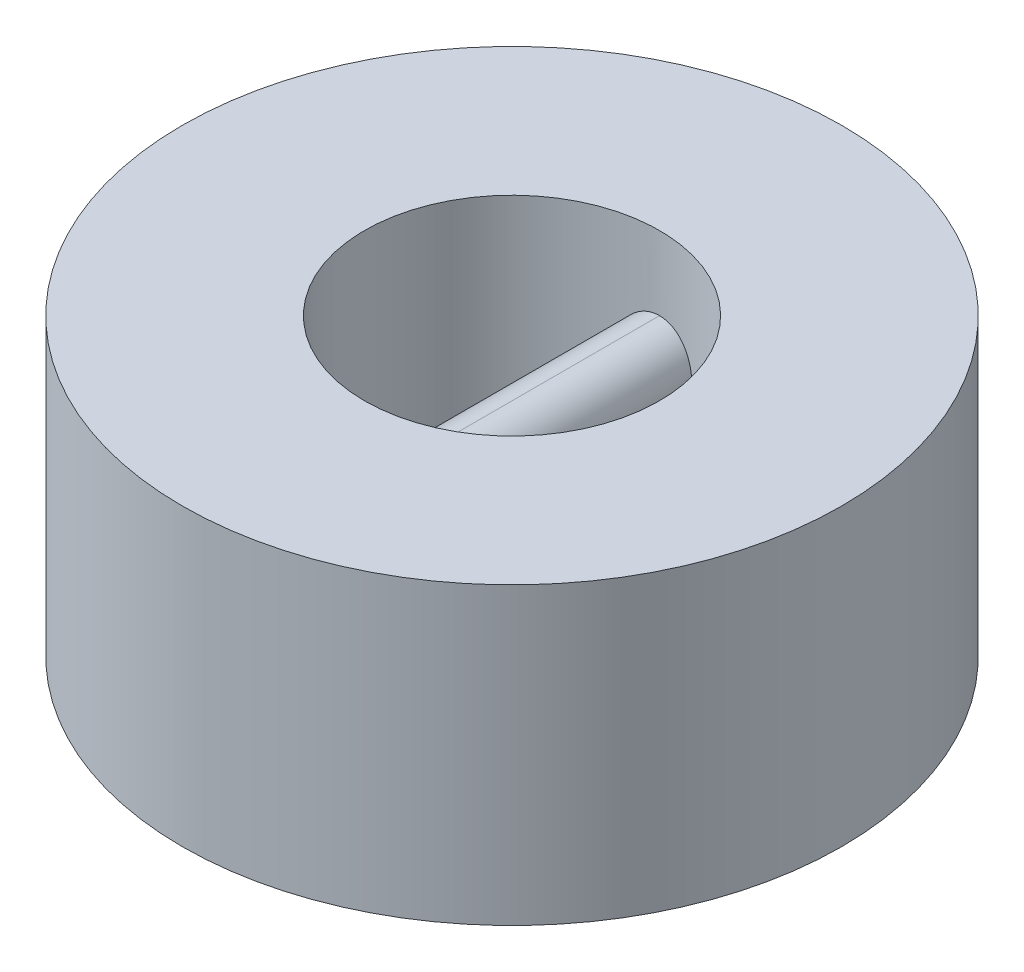
ISO-10303-21;
HEADER;
FILE_DESCRIPTION(('STEP AP214'),'2;1');
FILE_NAME('part.step','',(''),(''),'','','');
FILE_SCHEMA(('AUTOMOTIVE_DESIGN { 1 0 10303 214 1 1 1 1 }'));
ENDSEC;
DATA;
#1=APPLICATION_CONTEXT('core data for automotive mechanical design processes');
#2=APPLICATION_PROTOCOL_DEFINITION('international standard','automotive_design',2000,#1);
#3=PRODUCT_CONTEXT('',#1,'mechanical');
#4=PRODUCT('Part','Part','',(#3));
#5=PRODUCT_RELATED_PRODUCT_CATEGORY('part','',(#4));
#6=PRODUCT_DEFINITION_FORMATION('','',#4);
#7=PRODUCT_DEFINITION_CONTEXT('part definition',#1,'design');
#8=PRODUCT_DEFINITION('design','',#6,#7);
#9=PRODUCT_DEFINITION_SHAPE('','',#8);
#10=(LENGTH_UNIT() NAMED_UNIT(*) SI_UNIT(.MILLI.,.METRE.));
#11=(NAMED_UNIT(*) PLANE_ANGLE_UNIT() SI_UNIT($,.RADIAN.));
#12=(NAMED_UNIT(*) SI_UNIT($,.STERADIAN.) SOLID_ANGLE_UNIT());
#13=UNCERTAINTY_MEASURE_WITH_UNIT(LENGTH_MEASURE(1.E-05),#10,'distance_accuracy_value','');
#14=(GEOMETRIC_REPRESENTATION_CONTEXT(3) GLOBAL_UNCERTAINTY_ASSIGNED_CONTEXT((#13)) GLOBAL_UNIT_ASSIGNED_CONTEXT((#10,
#11,#12)) REPRESENTATION_CONTEXT('',''));
#15=CARTESIAN_POINT('',(0.,0.,0.));
#16=DIRECTION('',(0.,0.,1.));
#17=DIRECTION('',(1.,0.,0.));
#18=AXIS2_PLACEMENT_3D('',#15,#16,#17);
#19=CARTESIAN_POINT('',(0.,25.4,0.));
#20=DIRECTION('',(0.,-1.,0.));
#21=DIRECTION('',(0.,0.,-1.));
#22=AXIS2_PLACEMENT_3D('',#19,#20,#21);
#23=CYLINDRICAL_SURFACE('',#22,56.7645955077655);
#24=CARTESIAN_POINT('',(0.,25.4,0.));
#25=DIRECTION('',(0.,1.,0.));
#26=DIRECTION('',(0.,0.,1.));
#27=AXIS2_PLACEMENT_3D('',#24,#25,#26);
#28=CIRCLE('',#27,56.7645955077655);
#29=CARTESIAN_POINT('',(0.,25.4,56.7645955077655));
#30=VERTEX_POINT('',#29);
#31=EDGE_CURVE('E100',#30,#30,#28,.T.);
#32=ORIENTED_EDGE('',*,*,#31,.F.);
#33=EDGE_LOOP('',(#32));
#34=FACE_BOUND('',#33,.T.);
#35=CARTESIAN_POINT('',(0.,-25.4,0.));
#36=DIRECTION('',(0.,1.,0.));
#37=DIRECTION('',(0.,0.,1.));
#38=AXIS2_PLACEMENT_3D('',#35,#36,#37);
#39=CIRCLE('',#38,56.7645955077655);
#40=CARTESIAN_POINT('',(0.,-25.4,56.7645955077655));
#41=VERTEX_POINT('',#40);
#42=EDGE_CURVE('E104',#41,#41,#39,.T.);
#43=ORIENTED_EDGE('',*,*,#42,.T.);
#44=EDGE_LOOP('',(#43));
#45=FACE_BOUND('',#44,.T.);
#46=ADVANCED_FACE('F37',(#34,#45),#23,.T.);
#47=CARTESIAN_POINT('',(0.,25.4,0.));
#48=DIRECTION('',(0.,1.,0.));
#49=DIRECTION('',(0.,0.,1.));
#50=AXIS2_PLACEMENT_3D('',#47,#48,#49);
#51=PLANE('',#50);
#52=CARTESIAN_POINT('',(0.,25.4,0.));
#53=DIRECTION('',(0.,1.,0.));
#54=DIRECTION('',(0.,0.,1.));
#55=AXIS2_PLACEMENT_3D('',#52,#53,#54);
#56=CIRCLE('',#55,25.4);
#57=CARTESIAN_POINT('',(0.,25.4,25.4));
#58=VERTEX_POINT('',#57);
#59=EDGE_CURVE('E169',#58,#58,#56,.T.);
#60=ORIENTED_EDGE('',*,*,#59,.F.);
#61=EDGE_LOOP('',(#60));
#62=FACE_BOUND('',#61,.T.);
#63=ORIENTED_EDGE('',*,*,#31,.T.);
#64=EDGE_LOOP('',(#63));
#65=FACE_BOUND('',#64,.T.);
#66=ADVANCED_FACE('F125',(#62,#65),#51,.T.);
#67=CARTESIAN_POINT('',(0.,-25.4,0.));
#68=DIRECTION('',(0.,1.,0.));
#69=DIRECTION('',(0.,0.,1.));
#70=AXIS2_PLACEMENT_3D('',#67,#68,#69);
#71=PLANE('',#70);
#72=CARTESIAN_POINT('',(0.,-25.4,0.));
#73=DIRECTION('',(0.,1.,0.));
#74=DIRECTION('',(0.,0.,1.));
#75=AXIS2_PLACEMENT_3D('',#72,#73,#74);
#76=CIRCLE('',#75,25.4);
#77=CARTESIAN_POINT('',(0.,-25.4,25.4));
#78=VERTEX_POINT('',#77);
#79=EDGE_CURVE('E167',#78,#78,#76,.T.);
#80=ORIENTED_EDGE('',*,*,#79,.T.);
#81=EDGE_LOOP('',(#80));
#82=FACE_BOUND('',#81,.T.);
#83=ORIENTED_EDGE('',*,*,#42,.F.);
#84=EDGE_LOOP('',(#83));
#85=FACE_BOUND('',#84,.T.);
#86=ADVANCED_FACE('F124',(#82,#85),#71,.F.);
#87=CARTESIAN_POINT('',(0.,25.4,0.));
#88=DIRECTION('',(0.,-1.,0.));
#89=DIRECTION('',(0.,0.,-1.));
#90=AXIS2_PLACEMENT_3D('',#87,#88,#89);
#91=CYLINDRICAL_SURFACE('',#90,25.4);
#92=CARTESIAN_POINT('',(-6.35,6.35,-24.5934442484171));
#93=CARTESIAN_POINT('',(-6.35002227194527,6.52561230663582,-24.5934239927346));
#94=CARTESIAN_POINT('',(-6.34271602928819,6.70121754155172,-24.5953245336112));
#95=CARTESIAN_POINT('',(-6.31361032223786,7.05111477777355,-24.6028197742441));
#96=CARTESIAN_POINT('',(-6.29181329827677,7.2254069952106,-24.6084138519605));
#97=CARTESIAN_POINT('',(-6.23394880924157,7.57108618789087,-24.623133796363));
#98=CARTESIAN_POINT('',(-6.19791054295239,7.7424783639397,-24.6322524358168));
#99=CARTESIAN_POINT('',(-6.11186947681422,8.08151201134434,-24.6537426934591));
#100=CARTESIAN_POINT('',(-6.06186648577146,8.24915343131388,-24.6661143561854));
#101=CARTESIAN_POINT('',(-5.94831229287981,8.57947899433355,-24.6937438862104));
#102=CARTESIAN_POINT('',(-5.88476510397179,8.74216458943754,-24.7090008984732));
#103=CARTESIAN_POINT('',(-5.74457525001978,9.06160293422282,-24.7419691924501));
#104=CARTESIAN_POINT('',(-5.66792774357013,9.21835346426258,-24.7596813810499));
#105=CARTESIAN_POINT('',(-5.50212032510756,9.52482667069534,-24.7970540455721));
#106=CARTESIAN_POINT('',(-5.41296152003303,9.67454996726135,-24.8167143490896));
#107=CARTESIAN_POINT('',(-5.22271366631799,9.96608497019353,-24.8574480830195));
#108=CARTESIAN_POINT('',(-5.12162038676159,10.1078938444037,-24.8785220134296));
#109=CARTESIAN_POINT('',(-4.9061197613706,10.3853364870191,-24.921924087667));
#110=CARTESIAN_POINT('',(-4.79149125344267,10.520795944865,-24.9442686743028));
#111=CARTESIAN_POINT('',(-4.55132734389885,10.7816304952267,-24.9892044740816));
#112=CARTESIAN_POINT('',(-4.42579182524735,10.9070054795053,-25.0117956898687));
#113=CARTESIAN_POINT('',(-4.16458861400217,11.1468901748564,-25.0566111555918));
#114=CARTESIAN_POINT('',(-4.02891724783083,11.2613959120672,-25.0788352688789));
#115=CARTESIAN_POINT('',(-3.74841452327989,11.4786793130291,-25.1222913173633));
#116=CARTESIAN_POINT('',(-3.60358637431179,11.5814610509585,-25.143523595707));
#117=CARTESIAN_POINT('',(-3.30348900105029,11.7760394267589,-25.1847220960044));
#118=CARTESIAN_POINT('',(-3.14809798643044,11.8676532723995,-25.2046652401187));
#119=CARTESIAN_POINT('',(-2.8299383132475,12.0373938940376,-25.242367199895));
#120=CARTESIAN_POINT('',(-2.6671724296331,12.1155256905948,-25.2601268279618));
#121=CARTESIAN_POINT('',(-2.33540999905884,12.2576987594075,-25.2929558581139));
#122=CARTESIAN_POINT('',(-2.16641621313577,12.3217461900409,-25.3080264354386));
#123=CARTESIAN_POINT('',(-1.82343036647629,12.4352486370264,-25.3350493425419));
#124=CARTESIAN_POINT('',(-1.64943954845311,12.4847072475772,-25.3470024402792));
#125=CARTESIAN_POINT('',(-1.23261046983848,12.5841324737492,-25.3712184338473));
#126=CARTESIAN_POINT('',(-0.988067156213775,12.6275468384329,-25.3819668292946));
#127=CARTESIAN_POINT('',(-0.618813882655509,12.6709937824,-25.3927607621345));
#128=CARTESIAN_POINT('',(-0.495346717367013,12.6818636554792,-25.3954706206766));
#129=CARTESIAN_POINT('',(-0.247932014798074,12.6963671643469,-25.3990914576642));
#130=CARTESIAN_POINT('',(-0.123984369038978,12.6999990576339,-25.4000020029351));
#131=CARTESIAN_POINT('',(0.,12.7,-25.4));
#132=B_SPLINE_CURVE_WITH_KNOTS('',3,(#92,#93,#94,#95,#96,#97,#98,#99,#100,#101,#102,#103,#104,
#105,#106,#107,#108,#109,#110,#111,#112,#113,#114,#115,#116,#117,#118,#119,#120,#121,#122,#123,
#124,#125,#126,#127,#128,#129,#130,#131),.UNSPECIFIED.,.F.,.F.,(4,2,2,2,2,2,2,2,2,2,2,2,2,2,2,2,
2,2,2,4),(0.,0.526663939512959,1.05323920457144,1.57874038903873,2.10424876859807,
2.62960166388249,3.15514913215339,3.68065013184214,4.20633799063145,4.74227555780805,
5.27821887647133,5.81435739055571,6.3503090211691,6.89410473158633,7.43769749966614,
7.98105210753416,8.52427273892373,9.26802282823714,9.63975692173094,10.0115804972446),.UNSPECIFIED.);
#133=CARTESIAN_POINT('',(-6.35,6.35,-24.5934442484171));
#134=VERTEX_POINT('',#133);
#135=CARTESIAN_POINT('',(0.,12.7,-25.4));
#136=VERTEX_POINT('',#135);
#137=EDGE_CURVE('E138',#134,#136,#132,.T.);
#138=ORIENTED_EDGE('',*,*,#137,.T.);
#139=CARTESIAN_POINT('',(0.,12.7,-25.4));
#140=CARTESIAN_POINT('',(0.175699112745943,12.7000220804563,-25.400017975796));
#141=CARTESIAN_POINT('',(0.351391661153618,12.6927088115871,-25.3981775930792));
#142=CARTESIAN_POINT('',(0.70146847944646,12.6635736421459,-25.390910660224));
#143=CARTESIAN_POINT('',(0.875852948678401,12.641753999669,-25.3854846682306));
#144=CARTESIAN_POINT('',(1.22173410057335,12.5838249732516,-25.371191034762));
#145=CARTESIAN_POINT('',(1.39323578022403,12.5477437256559,-25.3623301705151));
#146=CARTESIAN_POINT('',(1.73249008753074,12.4615957285789,-25.3414156260248));
#147=CARTESIAN_POINT('',(1.90024267560781,12.4115288315272,-25.3293619120918));
#148=CARTESIAN_POINT('',(2.23079828457177,12.2978217165225,-25.3023919641378));
#149=CARTESIAN_POINT('',(2.39360246105478,12.234184695844,-25.2874764044829));
#150=CARTESIAN_POINT('',(2.71326830549007,12.0937932443795,-25.2551775719313));
#151=CARTESIAN_POINT('',(2.87012775233453,12.0170339686659,-25.2377933879854));
#152=CARTESIAN_POINT('',(3.17679611830026,11.8509878661557,-25.2010280861743));
#153=CARTESIAN_POINT('',(3.32660591396608,11.7617026023499,-25.1816472175351));
#154=CARTESIAN_POINT('',(3.61829097828095,11.5711900972236,-25.1413933023157));
#155=CARTESIAN_POINT('',(3.76016340825691,11.4699586232679,-25.1205197278967));
#156=CARTESIAN_POINT('',(4.03752149340217,11.2543179160353,-25.0774495203203));
#157=CARTESIAN_POINT('',(4.1728444995166,11.1397028600178,-25.055235750209));
#158=CARTESIAN_POINT('',(4.43340459333218,10.8995945735081,-25.0104458745798));
#159=CARTESIAN_POINT('',(4.5586415634769,10.7741012162606,-24.9878697648425));
#160=CARTESIAN_POINT('',(4.79825666182264,10.5130086354736,-24.9429669572739));
#161=CARTESIAN_POINT('',(4.91263050361572,10.3774054601307,-24.9206403609374));
#162=CARTESIAN_POINT('',(5.12965927844439,10.0970666078969,-24.8768737932251));
#163=CARTESIAN_POINT('',(5.23231826147259,9.95233411417394,-24.8554335170807));
#164=CARTESIAN_POINT('',(5.42675306700318,9.65231692226906,-24.8137138574612));
#165=CARTESIAN_POINT('',(5.51833490059263,9.4969031629791,-24.793457701424));
#166=CARTESIAN_POINT('',(5.68800918571879,9.17870159482844,-24.7550826627609));
#167=CARTESIAN_POINT('',(5.76610666043027,9.01591656055351,-24.7369629850583));
#168=CARTESIAN_POINT('',(5.90820875096747,8.6841194086145,-24.7034087739443));
#169=CARTESIAN_POINT('',(5.9722199872795,8.51511026005323,-24.6879729798355));
#170=CARTESIAN_POINT('',(6.08565076734827,8.17208836221375,-24.6602565008038));
#171=CARTESIAN_POINT('',(6.13507393782816,7.9980768683885,-24.6479750317865));
#172=CARTESIAN_POINT('',(6.23434903022083,7.58146255495799,-24.623088225217));
#173=CARTESIAN_POINT('',(6.27768000264913,7.33715972406042,-24.6120234297577));
#174=CARTESIAN_POINT('',(6.32104597393651,6.96825749872608,-24.6009057580366));
#175=CARTESIAN_POINT('',(6.33189620972373,6.84490213869051,-24.5981131298308));
#176=CARTESIAN_POINT('',(6.34637366253408,6.59771016979374,-24.5943809423169));
#177=CARTESIAN_POINT('',(6.34999911576239,6.47387345080924,-24.5934418355117));
#178=CARTESIAN_POINT('',(6.35,6.35,-24.5934442484171));
#179=B_SPLINE_CURVE_WITH_KNOTS('',3,(#139,#140,#141,#142,#143,#144,#145,#146,#147,#148,#149,
#150,#151,#152,#153,#154,#155,#156,#157,#158,#159,#160,#161,#162,#163,#164,#165,#166,#167,#168,
#169,#170,#171,#172,#173,#174,#175,#176,#177,#178),.UNSPECIFIED.,.F.,.F.,(4,2,2,2,2,2,2,2,2,2,2,
2,2,2,2,2,2,2,2,4),(0.,0.526925597782802,1.0537691923278,1.57957853781272,2.10539343161848,
2.63108457410907,3.15697023028003,3.68279032479073,4.20879728398118,4.74435095586272,
5.27991086891469,5.81568123454489,6.35126581200508,6.89517616377623,7.43888345960203,
7.98233466638267,8.52565065233463,9.2686898571845,9.64008996098021,10.0115807240259),.UNSPECIFIED.);
#180=CARTESIAN_POINT('',(6.35,6.35,-24.5934442484171));
#181=VERTEX_POINT('',#180);
#182=EDGE_CURVE('E47',#136,#181,#179,.T.);
#183=ORIENTED_EDGE('',*,*,#182,.T.);
#184=CARTESIAN_POINT('',(6.35,6.35,-24.5934442484171));
#185=CARTESIAN_POINT('',(6.35002227194526,6.17438769336418,-24.5934239927346));
#186=CARTESIAN_POINT('',(6.34271602928819,5.99878245844828,-24.5953245336112));
#187=CARTESIAN_POINT('',(6.31361032223786,5.64888522222645,-24.6028197742441));
#188=CARTESIAN_POINT('',(6.29181329827677,5.4745930047894,-24.6084138519605));
#189=CARTESIAN_POINT('',(6.23394880924157,5.12891381210913,-24.623133796363));
#190=CARTESIAN_POINT('',(6.19791054295238,4.9575216360603,-24.6322524358168));
#191=CARTESIAN_POINT('',(6.11186947681422,4.61848798865566,-24.6537426934591));
#192=CARTESIAN_POINT('',(6.06186648577146,4.45084656868612,-24.6661143561854));
#193=CARTESIAN_POINT('',(5.9483122928798,4.12052100566645,-24.6937438862104));
#194=CARTESIAN_POINT('',(5.88476510397178,3.95783541056246,-24.7090008984732));
#195=CARTESIAN_POINT('',(5.74457525001977,3.63839706577718,-24.7419691924501));
#196=CARTESIAN_POINT('',(5.66792774357012,3.48164653573742,-24.7596813810499));
#197=CARTESIAN_POINT('',(5.50212032510755,3.17517332930466,-24.7970540455721));
#198=CARTESIAN_POINT('',(5.41296152003302,3.02545003273865,-24.8167143490896));
#199=CARTESIAN_POINT('',(5.22271366631798,2.73391502980647,-24.8574480830195));
#200=CARTESIAN_POINT('',(5.12162038676159,2.59210615559632,-24.8785220134296));
#201=CARTESIAN_POINT('',(4.9061197613706,2.3146635129809,-24.921924087667));
#202=CARTESIAN_POINT('',(4.79149125344267,2.17920405513501,-24.9442686743028));
#203=CARTESIAN_POINT('',(4.55132734389885,1.91836950477326,-24.9892044740816));
#204=CARTESIAN_POINT('',(4.42579182524735,1.79299452049473,-25.0117956898687));
#205=CARTESIAN_POINT('',(4.16458861400217,1.55310982514357,-25.0566111555918));
#206=CARTESIAN_POINT('',(4.02891724783083,1.43860408793282,-25.0788352688789));
#207=CARTESIAN_POINT('',(3.74841452327989,1.22132068697092,-25.1222913173633));
#208=CARTESIAN_POINT('',(3.60358637431179,1.11853894904149,-25.143523595707));
#209=CARTESIAN_POINT('',(3.30348900105029,0.923960573241089,-25.1847220960044));
#210=CARTESIAN_POINT('',(3.14809798643044,0.83234672760047,-25.2046652401187));
#211=CARTESIAN_POINT('',(2.8299383132475,0.662606105962379,-25.242367199895));
#212=CARTESIAN_POINT('',(2.6671724296331,0.584474309405154,-25.2601268279618));
#213=CARTESIAN_POINT('',(2.33540999905883,0.442301240592473,-25.2929558581139));
#214=CARTESIAN_POINT('',(2.16641621313577,0.378253809959063,-25.3080264354386));
#215=CARTESIAN_POINT('',(1.82343036647629,0.264751362973618,-25.3350493425419));
#216=CARTESIAN_POINT('',(1.64943954845311,0.215292752422795,-25.3470024402792));
#217=CARTESIAN_POINT('',(1.23261046983848,0.11586752625075,-25.3712184338473));
#218=CARTESIAN_POINT('',(0.988067156213775,0.0724531615671009,-25.3819668292946));
#219=CARTESIAN_POINT('',(0.618813882655508,0.0290062175999961,-25.3927607621345));
#220=CARTESIAN_POINT('',(0.495346717367012,0.0181363445208444,-25.3954706206766));
#221=CARTESIAN_POINT('',(0.247932014798072,0.00363283565306978,-25.3990914576642));
#222=CARTESIAN_POINT('',(0.123984369038976,9.42366073517722E-07,-25.4000020029351));
#223=CARTESIAN_POINT('',(0.,0.,-25.4));
#224=B_SPLINE_CURVE_WITH_KNOTS('',3,(#184,#185,#186,#187,#188,#189,#190,#191,#192,#193,#194,
#195,#196,#197,#198,#199,#200,#201,#202,#203,#204,#205,#206,#207,#208,#209,#210,#211,#212,#213,
#214,#215,#216,#217,#218,#219,#220,#221,#222,#223),.UNSPECIFIED.,.F.,.F.,(4,2,2,2,2,2,2,2,2,2,2,
2,2,2,2,2,2,2,2,4),(0.,0.526663939512958,1.05323920457144,1.57874038903872,2.10424876859807,
2.62960166388249,3.15514913215339,3.68065013184214,4.20633799063145,4.74227555780805,
5.27821887647132,5.81435739055571,6.3503090211691,6.89410473158633,7.43769749966614,
7.98105210753415,8.52427273892373,9.26802282823714,9.63975692173094,10.0115804972446),.UNSPECIFIED.);
#225=CARTESIAN_POINT('',(0.,0.,-25.4));
#226=VERTEX_POINT('',#225);
#227=EDGE_CURVE('E93',#181,#226,#224,.T.);
#228=ORIENTED_EDGE('',*,*,#227,.T.);
#229=CARTESIAN_POINT('',(0.,0.,-25.4));
#230=CARTESIAN_POINT('',(-0.175699112745945,-2.20804563280517E-05,-25.400017975796));
#231=CARTESIAN_POINT('',(-0.35139166115362,0.00729118841288751,-25.3981775930792));
#232=CARTESIAN_POINT('',(-0.701468479446463,0.0364263578541068,-25.390910660224));
#233=CARTESIAN_POINT('',(-0.875852948678403,0.0582460003310183,-25.3854846682306));
#234=CARTESIAN_POINT('',(-1.22173410057335,0.116175026748358,-25.371191034762));
#235=CARTESIAN_POINT('',(-1.39323578022404,0.152256274344142,-25.3623301705151));
#236=CARTESIAN_POINT('',(-1.73249008753074,0.238404271421113,-25.3414156260248));
#237=CARTESIAN_POINT('',(-1.90024267560781,0.288471168472784,-25.3293619120918));
#238=CARTESIAN_POINT('',(-2.23079828457178,0.402178283477457,-25.3023919641378));
#239=CARTESIAN_POINT('',(-2.39360246105478,0.465815304156032,-25.2874764044829));
#240=CARTESIAN_POINT('',(-2.71326830549007,0.60620675562051,-25.2551775719313));
#241=CARTESIAN_POINT('',(-2.87012775233453,0.682966031334097,-25.2377933879854));
#242=CARTESIAN_POINT('',(-3.17679611830026,0.849012133844301,-25.2010280861743));
#243=CARTESIAN_POINT('',(-3.32660591396609,0.93829739765012,-25.1816472175351));
#244=CARTESIAN_POINT('',(-3.61829097828096,1.12880990277645,-25.1413933023157));
#245=CARTESIAN_POINT('',(-3.76016340825692,1.23004137673206,-25.1205197278967));
#246=CARTESIAN_POINT('',(-4.03752149340217,1.44568208396469,-25.0774495203203));
#247=CARTESIAN_POINT('',(-4.1728444995166,1.56029713998218,-25.055235750209));
#248=CARTESIAN_POINT('',(-4.43340459333218,1.80040542649192,-25.0104458745798));
#249=CARTESIAN_POINT('',(-4.5586415634769,1.92589878373936,-24.9878697648425));
#250=CARTESIAN_POINT('',(-4.79825666182264,2.18699136452638,-24.9429669572739));
#251=CARTESIAN_POINT('',(-4.91263050361572,2.32259453986927,-24.9206403609374));
#252=CARTESIAN_POINT('',(-5.12965927844439,2.60293339210308,-24.8768737932251));
#253=CARTESIAN_POINT('',(-5.23231826147259,2.74766588582606,-24.8554335170807));
#254=CARTESIAN_POINT('',(-5.42675306700318,3.04768307773094,-24.8137138574612));
#255=CARTESIAN_POINT('',(-5.51833490059264,3.2030968370209,-24.793457701424));
#256=CARTESIAN_POINT('',(-5.68800918571879,3.52129840517156,-24.7550826627609));
#257=CARTESIAN_POINT('',(-5.76610666043027,3.68408343944649,-24.7369629850583));
#258=CARTESIAN_POINT('',(-5.90820875096747,4.0158805913855,-24.7034087739443));
#259=CARTESIAN_POINT('',(-5.9722199872795,4.18488973994677,-24.6879729798355));
#260=CARTESIAN_POINT('',(-6.08565076734827,4.52791163778625,-24.6602565008038));
#261=CARTESIAN_POINT('',(-6.13507393782816,4.70192313161149,-24.6479750317865));
#262=CARTESIAN_POINT('',(-6.23434903022084,5.11853744504201,-24.623088225217));
#263=CARTESIAN_POINT('',(-6.27768000264913,5.36284027593958,-24.6120234297577));
#264=CARTESIAN_POINT('',(-6.32104597393651,5.73174250127392,-24.6009057580366));
#265=CARTESIAN_POINT('',(-6.33189620972373,5.85509786130948,-24.5981131298308));
#266=CARTESIAN_POINT('',(-6.34637366253409,6.10228983020626,-24.5943809423169));
#267=CARTESIAN_POINT('',(-6.34999911576239,6.22612654919075,-24.5934418355116));
#268=CARTESIAN_POINT('',(-6.35,6.35,-24.5934442484171));
#269=B_SPLINE_CURVE_WITH_KNOTS('',3,(#229,#230,#231,#232,#233,#234,#235,#236,#237,#238,#239,
#240,#241,#242,#243,#244,#245,#246,#247,#248,#249,#250,#251,#252,#253,#254,#255,#256,#257,#258,
#259,#260,#261,#262,#263,#264,#265,#266,#267,#268),.UNSPECIFIED.,.F.,.F.,(4,2,2,2,2,2,2,2,2,2,2,
2,2,2,2,2,2,2,2,4),(0.,0.526925597782802,1.0537691923278,1.57957853781271,2.10539343161848,
2.63108457410907,3.15697023028003,3.68279032479073,4.20879728398118,4.74435095586272,
5.27991086891469,5.81568123454488,6.35126581200508,6.89517616377623,7.43888345960202,
7.98233466638266,8.52565065233463,9.2686898571845,9.64008996098021,10.0115807240259),.UNSPECIFIED.);
#270=EDGE_CURVE('E85',#226,#134,#269,.T.);
#271=ORIENTED_EDGE('',*,*,#270,.T.);
#272=EDGE_LOOP('',(#138,#183,#228,#271));
#273=FACE_BOUND('',#272,.T.);
#274=CARTESIAN_POINT('',(0.,0.,25.4));
#275=CARTESIAN_POINT('',(0.17569911274594,-2.20804563294313E-05,25.400017975796));
#276=CARTESIAN_POINT('',(0.351391661153615,0.00729118841288655,25.3981775930792));
#277=CARTESIAN_POINT('',(0.701468479446457,0.0364263578541074,25.390910660224));
#278=CARTESIAN_POINT('',(0.875852948678397,0.0582460003310199,25.3854846682306));
#279=CARTESIAN_POINT('',(1.22173410057335,0.116175026748359,25.371191034762));
#280=CARTESIAN_POINT('',(1.39323578022403,0.152256274344142,25.3623301705151));
#281=CARTESIAN_POINT('',(1.73249008753074,0.238404271421113,25.3414156260248));
#282=CARTESIAN_POINT('',(1.90024267560781,0.288471168472784,25.3293619120918));
#283=CARTESIAN_POINT('',(2.23079828457177,0.402178283477458,25.3023919641378));
#284=CARTESIAN_POINT('',(2.39360246105477,0.465815304156032,25.2874764044829));
#285=CARTESIAN_POINT('',(2.71326830549006,0.60620675562051,25.2551775719313));
#286=CARTESIAN_POINT('',(2.87012775233452,0.682966031334097,25.2377933879854));
#287=CARTESIAN_POINT('',(3.17679611830025,0.8490121338443,25.2010280861743));
#288=CARTESIAN_POINT('',(3.32660591396608,0.938297397650119,25.1816472175351));
#289=CARTESIAN_POINT('',(3.61829097828095,1.12880990277645,25.1413933023157));
#290=CARTESIAN_POINT('',(3.76016340825691,1.23004137673206,25.1205197278967));
#291=CARTESIAN_POINT('',(4.03752149340217,1.44568208396469,25.0774495203203));
#292=CARTESIAN_POINT('',(4.1728444995166,1.56029713998218,25.055235750209));
#293=CARTESIAN_POINT('',(4.43340459333218,1.80040542649192,25.0104458745798));
#294=CARTESIAN_POINT('',(4.5586415634769,1.92589878373936,24.9878697648425));
#295=CARTESIAN_POINT('',(4.79825666182263,2.18699136452638,24.9429669572739));
#296=CARTESIAN_POINT('',(4.91263050361572,2.32259453986927,24.9206403609374));
#297=CARTESIAN_POINT('',(5.12965927844438,2.60293339210308,24.8768737932251));
#298=CARTESIAN_POINT('',(5.23231826147258,2.74766588582606,24.8554335170807));
#299=CARTESIAN_POINT('',(5.42675306700318,3.04768307773094,24.8137138574612));
#300=CARTESIAN_POINT('',(5.51833490059263,3.2030968370209,24.793457701424));
#301=CARTESIAN_POINT('',(5.68800918571878,3.52129840517156,24.7550826627609));
#302=CARTESIAN_POINT('',(5.76610666043026,3.68408343944649,24.7369629850583));
#303=CARTESIAN_POINT('',(5.90820875096746,4.0158805913855,24.7034087739443));
#304=CARTESIAN_POINT('',(5.97221998727949,4.18488973994678,24.6879729798355));
#305=CARTESIAN_POINT('',(6.08565076734827,4.52791163778625,24.6602565008038));
#306=CARTESIAN_POINT('',(6.13507393782816,4.7019231316115,24.6479750317865));
#307=CARTESIAN_POINT('',(6.23434903022083,5.11853744504201,24.623088225217));
#308=CARTESIAN_POINT('',(6.27768000264913,5.36284027593958,24.6120234297577));
#309=CARTESIAN_POINT('',(6.32104597393651,5.73174250127392,24.6009057580366));
#310=CARTESIAN_POINT('',(6.33189620972373,5.85509786130949,24.5981131298308));
#311=CARTESIAN_POINT('',(6.34637366253408,6.10228983020627,24.5943809423169));
#312=CARTESIAN_POINT('',(6.34999911576239,6.22612654919076,24.5934418355116));
#313=CARTESIAN_POINT('',(6.35,6.35,24.5934442484171));
#314=B_SPLINE_CURVE_WITH_KNOTS('',3,(#274,#275,#276,#277,#278,#279,#280,#281,#282,#283,#284,
#285,#286,#287,#288,#289,#290,#291,#292,#293,#294,#295,#296,#297,#298,#299,#300,#301,#302,#303,
#304,#305,#306,#307,#308,#309,#310,#311,#312,#313),.UNSPECIFIED.,.F.,.F.,(4,2,2,2,2,2,2,2,2,2,2,
2,2,2,2,2,2,2,2,4),(0.,0.526925597782802,1.0537691923278,1.57957853781271,2.10539343161848,
2.63108457410907,3.15697023028003,3.68279032479073,4.20879728398118,4.74435095586272,
5.27991086891469,5.81568123454488,6.35126581200508,6.89517616377623,7.43888345960203,
7.98233466638267,8.52565065233464,9.2686898571845,9.64008996098021,10.0115807240259),.UNSPECIFIED.);
#315=CARTESIAN_POINT('',(0.,0.,25.4));
#316=VERTEX_POINT('',#315);
#317=CARTESIAN_POINT('',(6.35,6.35,24.5934442484171));
#318=VERTEX_POINT('',#317);
#319=EDGE_CURVE('E54',#316,#318,#314,.T.);
#320=ORIENTED_EDGE('',*,*,#319,.T.);
#321=CARTESIAN_POINT('',(6.35,6.35,24.5934442484171));
#322=CARTESIAN_POINT('',(6.35002227194527,6.52561230663582,24.5934239927346));
#323=CARTESIAN_POINT('',(6.34271602928819,6.70121754155172,24.5953245336112));
#324=CARTESIAN_POINT('',(6.31361032223786,7.05111477777355,24.6028197742441));
#325=CARTESIAN_POINT('',(6.29181329827677,7.2254069952106,24.6084138519605));
#326=CARTESIAN_POINT('',(6.23394880924157,7.57108618789087,24.623133796363));
#327=CARTESIAN_POINT('',(6.19791054295239,7.7424783639397,24.6322524358168));
#328=CARTESIAN_POINT('',(6.11186947681422,8.08151201134434,24.6537426934591));
#329=CARTESIAN_POINT('',(6.06186648577146,8.24915343131388,24.6661143561854));
#330=CARTESIAN_POINT('',(5.94831229287981,8.57947899433355,24.6937438862104));
#331=CARTESIAN_POINT('',(5.88476510397178,8.74216458943754,24.7090008984732));
#332=CARTESIAN_POINT('',(5.74457525001978,9.06160293422282,24.7419691924501));
#333=CARTESIAN_POINT('',(5.66792774357013,9.21835346426258,24.7596813810499));
#334=CARTESIAN_POINT('',(5.50212032510755,9.52482667069534,24.7970540455721));
#335=CARTESIAN_POINT('',(5.41296152003303,9.67454996726135,24.8167143490896));
#336=CARTESIAN_POINT('',(5.22271366631798,9.96608497019353,24.8574480830195));
#337=CARTESIAN_POINT('',(5.12162038676159,10.1078938444037,24.8785220134296));
#338=CARTESIAN_POINT('',(4.9061197613706,10.3853364870191,24.921924087667));
#339=CARTESIAN_POINT('',(4.79149125344267,10.520795944865,24.9442686743028));
#340=CARTESIAN_POINT('',(4.55132734389885,10.7816304952267,24.9892044740816));
#341=CARTESIAN_POINT('',(4.42579182524735,10.9070054795053,25.0117956898687));
#342=CARTESIAN_POINT('',(4.16458861400217,11.1468901748564,25.0566111555918));
#343=CARTESIAN_POINT('',(4.02891724783083,11.2613959120672,25.0788352688789));
#344=CARTESIAN_POINT('',(3.74841452327989,11.4786793130291,25.1222913173633));
#345=CARTESIAN_POINT('',(3.60358637431179,11.5814610509585,25.143523595707));
#346=CARTESIAN_POINT('',(3.30348900105029,11.7760394267589,25.1847220960044));
#347=CARTESIAN_POINT('',(3.14809798643044,11.8676532723995,25.2046652401187));
#348=CARTESIAN_POINT('',(2.8299383132475,12.0373938940376,25.242367199895));
#349=CARTESIAN_POINT('',(2.6671724296331,12.1155256905948,25.2601268279618));
#350=CARTESIAN_POINT('',(2.33540999905883,12.2576987594075,25.2929558581139));
#351=CARTESIAN_POINT('',(2.16641621313577,12.3217461900409,25.3080264354386));
#352=CARTESIAN_POINT('',(1.82343036647629,12.4352486370264,25.3350493425419));
#353=CARTESIAN_POINT('',(1.64943954845311,12.4847072475772,25.3470024402792));
#354=CARTESIAN_POINT('',(1.23261046983848,12.5841324737492,25.3712184338473));
#355=CARTESIAN_POINT('',(0.988067156213775,12.6275468384329,25.3819668292946));
#356=CARTESIAN_POINT('',(0.618813882655509,12.6709937824,25.3927607621345));
#357=CARTESIAN_POINT('',(0.495346717367014,12.6818636554792,25.3954706206766));
#358=CARTESIAN_POINT('',(0.247932014798075,12.6963671643469,25.3990914576643));
#359=CARTESIAN_POINT('',(0.123984369038979,12.6999990576339,25.4000020029351));
#360=CARTESIAN_POINT('',(0.,12.7,25.4));
#361=B_SPLINE_CURVE_WITH_KNOTS('',3,(#321,#322,#323,#324,#325,#326,#327,#328,#329,#330,#331,
#332,#333,#334,#335,#336,#337,#338,#339,#340,#341,#342,#343,#344,#345,#346,#347,#348,#349,#350,
#351,#352,#353,#354,#355,#356,#357,#358,#359,#360),.UNSPECIFIED.,.F.,.F.,(4,2,2,2,2,2,2,2,2,2,2,
2,2,2,2,2,2,2,2,4),(0.,0.526663939512959,1.05323920457144,1.57874038903873,2.10424876859807,
2.62960166388249,3.1551491321534,3.68065013184215,4.20633799063145,4.74227555780805,
5.27821887647133,5.81435739055571,6.3503090211691,6.89410473158633,7.43769749966614,
7.98105210753416,8.52427273892373,9.26802282823714,9.63975692173094,10.0115804972446),.UNSPECIFIED.);
#362=CARTESIAN_POINT('',(0.,12.7,25.4));
#363=VERTEX_POINT('',#362);
#364=EDGE_CURVE('E11',#318,#363,#361,.T.);
#365=ORIENTED_EDGE('',*,*,#364,.T.);
#366=CARTESIAN_POINT('',(0.,12.7,25.4));
#367=CARTESIAN_POINT('',(-0.175699112745943,12.7000220804563,25.400017975796));
#368=CARTESIAN_POINT('',(-0.351391661153618,12.6927088115871,25.3981775930792));
#369=CARTESIAN_POINT('',(-0.70146847944646,12.6635736421459,25.390910660224));
#370=CARTESIAN_POINT('',(-0.875852948678401,12.641753999669,25.3854846682306));
#371=CARTESIAN_POINT('',(-1.22173410057335,12.5838249732516,25.371191034762));
#372=CARTESIAN_POINT('',(-1.39323578022403,12.5477437256559,25.3623301705151));
#373=CARTESIAN_POINT('',(-1.73249008753074,12.4615957285789,25.3414156260248));
#374=CARTESIAN_POINT('',(-1.90024267560781,12.4115288315272,25.3293619120918));
#375=CARTESIAN_POINT('',(-2.23079828457177,12.2978217165225,25.3023919641378));
#376=CARTESIAN_POINT('',(-2.39360246105478,12.234184695844,25.2874764044829));
#377=CARTESIAN_POINT('',(-2.71326830549007,12.0937932443795,25.2551775719313));
#378=CARTESIAN_POINT('',(-2.87012775233453,12.0170339686659,25.2377933879854));
#379=CARTESIAN_POINT('',(-3.17679611830026,11.8509878661557,25.2010280861743));
#380=CARTESIAN_POINT('',(-3.32660591396608,11.7617026023499,25.1816472175351));
#381=CARTESIAN_POINT('',(-3.61829097828095,11.5711900972236,25.1413933023157));
#382=CARTESIAN_POINT('',(-3.76016340825691,11.4699586232679,25.1205197278967));
#383=CARTESIAN_POINT('',(-4.03752149340217,11.2543179160353,25.0774495203203));
#384=CARTESIAN_POINT('',(-4.1728444995166,11.1397028600178,25.055235750209));
#385=CARTESIAN_POINT('',(-4.43340459333218,10.8995945735081,25.0104458745798));
#386=CARTESIAN_POINT('',(-4.5586415634769,10.7741012162606,24.9878697648425));
#387=CARTESIAN_POINT('',(-4.79825666182264,10.5130086354736,24.9429669572739));
#388=CARTESIAN_POINT('',(-4.91263050361572,10.3774054601307,24.9206403609374));
#389=CARTESIAN_POINT('',(-5.12965927844439,10.0970666078969,24.8768737932251));
#390=CARTESIAN_POINT('',(-5.23231826147259,9.95233411417394,24.8554335170807));
#391=CARTESIAN_POINT('',(-5.42675306700318,9.65231692226906,24.8137138574612));
#392=CARTESIAN_POINT('',(-5.51833490059264,9.49690316297909,24.793457701424));
#393=CARTESIAN_POINT('',(-5.68800918571879,9.17870159482844,24.7550826627609));
#394=CARTESIAN_POINT('',(-5.76610666043027,9.01591656055351,24.7369629850583));
#395=CARTESIAN_POINT('',(-5.90820875096746,8.6841194086145,24.7034087739443));
#396=CARTESIAN_POINT('',(-5.9722199872795,8.51511026005323,24.6879729798355));
#397=CARTESIAN_POINT('',(-6.08565076734827,8.17208836221375,24.6602565008038));
#398=CARTESIAN_POINT('',(-6.13507393782816,7.9980768683885,24.6479750317865));
#399=CARTESIAN_POINT('',(-6.23434903022083,7.58146255495799,24.623088225217));
#400=CARTESIAN_POINT('',(-6.27768000264913,7.33715972406042,24.6120234297577));
#401=CARTESIAN_POINT('',(-6.32104597393651,6.96825749872608,24.6009057580366));
#402=CARTESIAN_POINT('',(-6.33189620972373,6.84490213869051,24.5981131298308));
#403=CARTESIAN_POINT('',(-6.34637366253408,6.59771016979373,24.5943809423169));
#404=CARTESIAN_POINT('',(-6.34999911576239,6.47387345080924,24.5934418355117));
#405=CARTESIAN_POINT('',(-6.35,6.35,24.5934442484171));
#406=B_SPLINE_CURVE_WITH_KNOTS('',3,(#366,#367,#368,#369,#370,#371,#372,#373,#374,#375,#376,
#377,#378,#379,#380,#381,#382,#383,#384,#385,#386,#387,#388,#389,#390,#391,#392,#393,#394,#395,
#396,#397,#398,#399,#400,#401,#402,#403,#404,#405),.UNSPECIFIED.,.F.,.F.,(4,2,2,2,2,2,2,2,2,2,2,
2,2,2,2,2,2,2,2,4),(0.,0.526925597782802,1.0537691923278,1.57957853781272,2.10539343161848,
2.63108457410907,3.15697023028003,3.68279032479073,4.20879728398118,4.74435095586272,
5.27991086891469,5.81568123454489,6.35126581200508,6.89517616377623,7.43888345960203,
7.98233466638267,8.52565065233463,9.2686898571845,9.64008996098021,10.0115807240259),.UNSPECIFIED.);
#407=CARTESIAN_POINT('',(-6.35,6.35,24.5934442484171));
#408=VERTEX_POINT('',#407);
#409=EDGE_CURVE('E98',#363,#408,#406,.T.);
#410=ORIENTED_EDGE('',*,*,#409,.T.);
#411=CARTESIAN_POINT('',(-6.35,6.35,24.5934442484171));
#412=CARTESIAN_POINT('',(-6.35002227194527,6.17438769336418,24.5934239927346));
#413=CARTESIAN_POINT('',(-6.34271602928819,5.99878245844828,24.5953245336112));
#414=CARTESIAN_POINT('',(-6.31361032223786,5.64888522222645,24.6028197742441));
#415=CARTESIAN_POINT('',(-6.29181329827677,5.4745930047894,24.6084138519605));
#416=CARTESIAN_POINT('',(-6.23394880924157,5.12891381210913,24.623133796363));
#417=CARTESIAN_POINT('',(-6.19791054295239,4.9575216360603,24.6322524358168));
#418=CARTESIAN_POINT('',(-6.11186947681422,4.61848798865566,24.6537426934591));
#419=CARTESIAN_POINT('',(-6.06186648577147,4.45084656868612,24.6661143561854));
#420=CARTESIAN_POINT('',(-5.94831229287981,4.12052100566645,24.6937438862104));
#421=CARTESIAN_POINT('',(-5.88476510397179,3.95783541056246,24.7090008984732));
#422=CARTESIAN_POINT('',(-5.74457525001978,3.63839706577718,24.7419691924501));
#423=CARTESIAN_POINT('',(-5.66792774357013,3.48164653573742,24.7596813810499));
#424=CARTESIAN_POINT('',(-5.50212032510756,3.17517332930466,24.7970540455721));
#425=CARTESIAN_POINT('',(-5.41296152003303,3.02545003273865,24.8167143490896));
#426=CARTESIAN_POINT('',(-5.22271366631799,2.73391502980647,24.8574480830195));
#427=CARTESIAN_POINT('',(-5.12162038676159,2.59210615559632,24.8785220134296));
#428=CARTESIAN_POINT('',(-4.90611976137061,2.3146635129809,24.921924087667));
#429=CARTESIAN_POINT('',(-4.79149125344267,2.17920405513501,24.9442686743028));
#430=CARTESIAN_POINT('',(-4.55132734389885,1.91836950477326,24.9892044740816));
#431=CARTESIAN_POINT('',(-4.42579182524736,1.79299452049473,25.0117956898687));
#432=CARTESIAN_POINT('',(-4.16458861400217,1.55310982514357,25.0566111555918));
#433=CARTESIAN_POINT('',(-4.02891724783084,1.43860408793283,25.0788352688789));
#434=CARTESIAN_POINT('',(-3.7484145232799,1.22132068697092,25.1222913173633));
#435=CARTESIAN_POINT('',(-3.6035863743118,1.11853894904149,25.143523595707));
#436=CARTESIAN_POINT('',(-3.30348900105029,0.923960573241089,25.1847220960044));
#437=CARTESIAN_POINT('',(-3.14809798643045,0.832346727600471,25.2046652401187));
#438=CARTESIAN_POINT('',(-2.82993831324751,0.66260610596238,25.242367199895));
#439=CARTESIAN_POINT('',(-2.66717242963311,0.584474309405155,25.2601268279618));
#440=CARTESIAN_POINT('',(-2.33540999905884,0.442301240592473,25.2929558581139));
#441=CARTESIAN_POINT('',(-2.16641621313578,0.378253809959063,25.3080264354386));
#442=CARTESIAN_POINT('',(-1.8234303664763,0.264751362973618,25.3350493425419));
#443=CARTESIAN_POINT('',(-1.64943954845311,0.215292752422795,25.3470024402792));
#444=CARTESIAN_POINT('',(-1.23261046983849,0.11586752625075,25.3712184338473));
#445=CARTESIAN_POINT('',(-0.98806715621378,0.0724531615671014,25.3819668292946));
#446=CARTESIAN_POINT('',(-0.618813882655513,0.0290062175999966,25.3927607621345));
#447=CARTESIAN_POINT('',(-0.495346717367017,0.0181363445208449,25.3954706206766));
#448=CARTESIAN_POINT('',(-0.247932014798077,0.00363283565307029,25.3990914576642));
#449=CARTESIAN_POINT('',(-0.123984369038981,9.42366074009162E-07,25.4000020029351));
#450=CARTESIAN_POINT('',(0.,0.,25.4));
#451=B_SPLINE_CURVE_WITH_KNOTS('',3,(#411,#412,#413,#414,#415,#416,#417,#418,#419,#420,#421,
#422,#423,#424,#425,#426,#427,#428,#429,#430,#431,#432,#433,#434,#435,#436,#437,#438,#439,#440,
#441,#442,#443,#444,#445,#446,#447,#448,#449,#450),.UNSPECIFIED.,.F.,.F.,(4,2,2,2,2,2,2,2,2,2,2,
2,2,2,2,2,2,2,2,4),(0.,0.526663939512958,1.05323920457144,1.57874038903872,2.10424876859807,
2.62960166388249,3.15514913215339,3.68065013184214,4.20633799063145,4.74227555780805,
5.27821887647132,5.81435739055571,6.3503090211691,6.89410473158633,7.43769749966613,
7.98105210753415,8.52427273892373,9.26802282823714,9.63975692173094,10.0115804972446),.UNSPECIFIED.);
#452=EDGE_CURVE('E83',#408,#316,#451,.T.);
#453=ORIENTED_EDGE('',*,*,#452,.T.);
#454=EDGE_LOOP('',(#320,#365,#410,#453));
#455=FACE_BOUND('',#454,.T.);
#456=ORIENTED_EDGE('',*,*,#59,.T.);
#457=EDGE_LOOP('',(#456));
#458=FACE_BOUND('',#457,.T.);
#459=ORIENTED_EDGE('',*,*,#79,.F.);
#460=EDGE_LOOP('',(#459));
#461=FACE_BOUND('',#460,.T.);
#462=ADVANCED_FACE('F95',(#273,#455,#458,#461),#91,.F.);
#463=CARTESIAN_POINT('',(0.,6.35,0.));
#464=DIRECTION('',(0.,0.,1.));
#465=DIRECTION('',(1.,0.,0.));
#466=AXIS2_PLACEMENT_3D('',#463,#464,#465);
#467=CYLINDRICAL_SURFACE('',#466,6.35);
#468=DIRECTION('',(0.,0.,-1.));
#469=VECTOR('',#468,1.);
#470=CARTESIAN_POINT('',(0.,12.7,-24.5934442484171));
#471=LINE('',#470,#469);
#472=EDGE_CURVE('E88',#363,#136,#471,.T.);
#473=ORIENTED_EDGE('',*,*,#472,.F.);
#474=ORIENTED_EDGE('',*,*,#364,.F.);
#475=DIRECTION('',(0.,0.,-1.));
#476=VECTOR('',#475,1.);
#477=CARTESIAN_POINT('',(6.35,6.35,24.5934442484171));
#478=LINE('',#477,#476);
#479=EDGE_CURVE('E42',#181,#318,#478,.F.);
#480=ORIENTED_EDGE('',*,*,#479,.F.);
#481=ORIENTED_EDGE('',*,*,#182,.F.);
#482=EDGE_LOOP('',(#473,#474,#480,#481));
#483=FACE_BOUND('',#482,.T.);
#484=ADVANCED_FACE('F39',(#483),#467,.T.);
#485=CARTESIAN_POINT('',(0.,6.35,25.4));
#486=DIRECTION('',(0.,0.,-1.));
#487=DIRECTION('',(-1.,0.,0.));
#488=AXIS2_PLACEMENT_3D('',#485,#486,#487);
#489=CYLINDRICAL_SURFACE('',#488,6.35);
#490=ORIENTED_EDGE('',*,*,#479,.T.);
#491=ORIENTED_EDGE('',*,*,#319,.F.);
#492=DIRECTION('',(0.,0.,-1.));
#493=VECTOR('',#492,1.);
#494=CARTESIAN_POINT('',(0.,0.,0.));
#495=LINE('',#494,#493);
#496=EDGE_CURVE('E81',#226,#316,#495,.F.);
#497=ORIENTED_EDGE('',*,*,#496,.F.);
#498=ORIENTED_EDGE('',*,*,#227,.F.);
#499=EDGE_LOOP('',(#490,#491,#497,#498));
#500=FACE_BOUND('',#499,.T.);
#501=ADVANCED_FACE('F92',(#500),#489,.T.);
#502=CARTESIAN_POINT('',(0.,6.35,0.));
#503=DIRECTION('',(0.,0.,-1.));
#504=DIRECTION('',(-1.,0.,0.));
#505=AXIS2_PLACEMENT_3D('',#502,#503,#504);
#506=CYLINDRICAL_SURFACE('',#505,6.35);
#507=ORIENTED_EDGE('',*,*,#472,.T.);
#508=ORIENTED_EDGE('',*,*,#137,.F.);
#509=DIRECTION('',(0.,0.,1.));
#510=VECTOR('',#509,1.);
#511=CARTESIAN_POINT('',(-6.35,6.35,-24.5934442484171));
#512=LINE('',#511,#510);
#513=EDGE_CURVE('E89',#408,#134,#512,.F.);
#514=ORIENTED_EDGE('',*,*,#513,.F.);
#515=ORIENTED_EDGE('',*,*,#409,.F.);
#516=EDGE_LOOP('',(#507,#508,#514,#515));
#517=FACE_BOUND('',#516,.T.);
#518=ADVANCED_FACE('F222',(#517),#506,.T.);
#519=CARTESIAN_POINT('',(0.,6.35,25.4));
#520=DIRECTION('',(0.,0.,1.));
#521=DIRECTION('',(1.,0.,0.));
#522=AXIS2_PLACEMENT_3D('',#519,#520,#521);
#523=CYLINDRICAL_SURFACE('',#522,6.35);
#524=ORIENTED_EDGE('',*,*,#270,.F.);
#525=ORIENTED_EDGE('',*,*,#496,.T.);
#526=ORIENTED_EDGE('',*,*,#452,.F.);
#527=ORIENTED_EDGE('',*,*,#513,.T.);
#528=EDGE_LOOP('',(#524,#525,#526,#527));
#529=FACE_BOUND('',#528,.T.);
#530=ADVANCED_FACE('F82',(#529),#523,.T.);
#531=CLOSED_SHELL('',(#46,#66,#86,#462,#484,#501,#518,#530));
#532=MANIFOLD_SOLID_BREP('B2',#531);
#533=ADVANCED_BREP_SHAPE_REPRESENTATION('',(#18,#532),#14);
#534=SHAPE_DEFINITION_REPRESENTATION(#9,#533);
ENDSEC;
END-ISO-10303-21;
